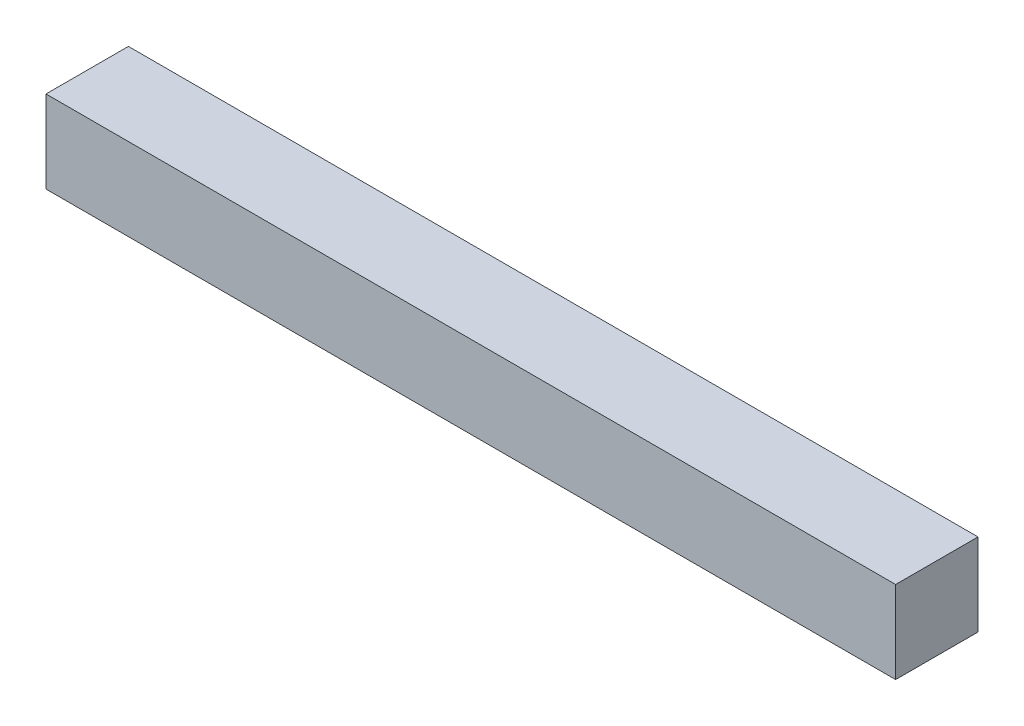
ISO-10303-21;
HEADER;
FILE_DESCRIPTION(('STEP AP214'),'2;1');
FILE_NAME('part.step','',(''),(''),'','','');
FILE_SCHEMA(('AUTOMOTIVE_DESIGN { 1 0 10303 214 1 1 1 1 }'));
ENDSEC;
DATA;
#1=APPLICATION_CONTEXT('core data for automotive mechanical design processes');
#2=APPLICATION_PROTOCOL_DEFINITION('international standard','automotive_design',2000,#1);
#3=PRODUCT_CONTEXT('',#1,'mechanical');
#4=PRODUCT('Part','Part','',(#3));
#5=PRODUCT_RELATED_PRODUCT_CATEGORY('part','',(#4));
#6=PRODUCT_DEFINITION_FORMATION('','',#4);
#7=PRODUCT_DEFINITION_CONTEXT('part definition',#1,'design');
#8=PRODUCT_DEFINITION('design','',#6,#7);
#9=PRODUCT_DEFINITION_SHAPE('','',#8);
#10=(LENGTH_UNIT() NAMED_UNIT(*) SI_UNIT(.MILLI.,.METRE.));
#11=(NAMED_UNIT(*) PLANE_ANGLE_UNIT() SI_UNIT($,.RADIAN.));
#12=(NAMED_UNIT(*) SI_UNIT($,.STERADIAN.) SOLID_ANGLE_UNIT());
#13=UNCERTAINTY_MEASURE_WITH_UNIT(LENGTH_MEASURE(1.E-05),#10,'distance_accuracy_value','');
#14=(GEOMETRIC_REPRESENTATION_CONTEXT(3) GLOBAL_UNCERTAINTY_ASSIGNED_CONTEXT((#13)) GLOBAL_UNIT_ASSIGNED_CONTEXT((#10,
#11,#12)) REPRESENTATION_CONTEXT('',''));
#15=CARTESIAN_POINT('',(0.,0.,0.));
#16=DIRECTION('',(0.,0.,1.));
#17=DIRECTION('',(1.,0.,0.));
#18=AXIS2_PLACEMENT_3D('',#15,#16,#17);
#19=CARTESIAN_POINT('',(1.08279990277916E-13,1.6,1.6));
#20=DIRECTION('',(0.,-1.,0.));
#21=DIRECTION('',(0.,0.,1.));
#22=AXIS2_PLACEMENT_3D('',#19,#20,#21);
#23=PLANE('',#22);
#24=DIRECTION('',(0.,0.,-1.));
#25=VECTOR('',#24,1.);
#26=CARTESIAN_POINT('',(33.0000000000001,1.60000000000012,1.6));
#27=LINE('',#26,#25);
#28=CARTESIAN_POINT('',(33.0000000000001,1.60000000000012,1.6));
#29=VERTEX_POINT('',#28);
#30=CARTESIAN_POINT('',(33.0000000000001,1.60000000000012,-1.6));
#31=VERTEX_POINT('',#30);
#32=EDGE_CURVE('E113',#29,#31,#27,.T.);
#33=ORIENTED_EDGE('',*,*,#32,.T.);
#34=DIRECTION('',(1.,0.,0.));
#35=VECTOR('',#34,1.);
#36=CARTESIAN_POINT('',(1.08279990277916E-13,1.6,-1.6));
#37=LINE('',#36,#35);
#38=CARTESIAN_POINT('',(1.08279990277916E-13,1.6,-1.6));
#39=VERTEX_POINT('',#38);
#40=EDGE_CURVE('E11',#39,#31,#37,.T.);
#41=ORIENTED_EDGE('',*,*,#40,.F.);
#42=DIRECTION('',(0.,0.,-1.));
#43=VECTOR('',#42,1.);
#44=CARTESIAN_POINT('',(1.08279990277916E-13,1.6,1.6));
#45=LINE('',#44,#43);
#46=CARTESIAN_POINT('',(1.08279990277916E-13,1.6,1.6));
#47=VERTEX_POINT('',#46);
#48=EDGE_CURVE('E97',#47,#39,#45,.T.);
#49=ORIENTED_EDGE('',*,*,#48,.F.);
#50=DIRECTION('',(1.,0.,0.));
#51=VECTOR('',#50,1.);
#52=CARTESIAN_POINT('',(1.08279990277916E-13,1.6,1.6));
#53=LINE('',#52,#51);
#54=EDGE_CURVE('E109',#47,#29,#53,.T.);
#55=ORIENTED_EDGE('',*,*,#54,.T.);
#56=EDGE_LOOP('',(#33,#41,#49,#55));
#57=FACE_BOUND('',#56,.T.);
#58=ADVANCED_FACE('F45',(#57),#23,.F.);
#59=CARTESIAN_POINT('',(1.22157778085731E-13,-1.6,-1.6));
#60=DIRECTION('',(0.,0.,1.));
#61=DIRECTION('',(0.,1.,0.));
#62=AXIS2_PLACEMENT_3D('',#59,#60,#61);
#63=PLANE('',#62);
#64=DIRECTION('',(0.,-1.,0.));
#65=VECTOR('',#64,1.);
#66=CARTESIAN_POINT('',(33.0000000000001,-1.59999999999988,-1.6));
#67=LINE('',#66,#65);
#68=CARTESIAN_POINT('',(33.0000000000001,-1.59999999999988,-1.6));
#69=VERTEX_POINT('',#68);
#70=EDGE_CURVE('E102',#31,#69,#67,.T.);
#71=ORIENTED_EDGE('',*,*,#70,.T.);
#72=DIRECTION('',(1.,0.,0.));
#73=VECTOR('',#72,1.);
#74=CARTESIAN_POINT('',(1.22157778085731E-13,-1.6,-1.6));
#75=LINE('',#74,#73);
#76=CARTESIAN_POINT('',(1.22157778085731E-13,-1.6,-1.6));
#77=VERTEX_POINT('',#76);
#78=EDGE_CURVE('E54',#77,#69,#75,.T.);
#79=ORIENTED_EDGE('',*,*,#78,.F.);
#80=DIRECTION('',(0.,-1.,0.));
#81=VECTOR('',#80,1.);
#82=CARTESIAN_POINT('',(1.22157778085731E-13,-1.6,-1.6));
#83=LINE('',#82,#81);
#84=EDGE_CURVE('E92',#39,#77,#83,.T.);
#85=ORIENTED_EDGE('',*,*,#84,.F.);
#86=ORIENTED_EDGE('',*,*,#40,.T.);
#87=EDGE_LOOP('',(#71,#79,#85,#86));
#88=FACE_BOUND('',#87,.T.);
#89=ADVANCED_FACE('F101',(#88),#63,.F.);
#90=CARTESIAN_POINT('',(1.22157778085731E-13,-1.6,1.6));
#91=DIRECTION('',(0.,1.,0.));
#92=DIRECTION('',(0.,0.,-1.));
#93=AXIS2_PLACEMENT_3D('',#90,#91,#92);
#94=PLANE('',#93);
#95=DIRECTION('',(0.,0.,1.));
#96=VECTOR('',#95,1.);
#97=CARTESIAN_POINT('',(33.0000000000001,-1.59999999999988,1.6));
#98=LINE('',#97,#96);
#99=CARTESIAN_POINT('',(33.0000000000001,-1.59999999999988,1.6));
#100=VERTEX_POINT('',#99);
#101=EDGE_CURVE('E79',#69,#100,#98,.T.);
#102=ORIENTED_EDGE('',*,*,#101,.T.);
#103=DIRECTION('',(1.,0.,0.));
#104=VECTOR('',#103,1.);
#105=CARTESIAN_POINT('',(1.22157778085731E-13,-1.6,1.6));
#106=LINE('',#105,#104);
#107=CARTESIAN_POINT('',(1.22157778085731E-13,-1.6,1.6));
#108=VERTEX_POINT('',#107);
#109=EDGE_CURVE('E104',#108,#100,#106,.T.);
#110=ORIENTED_EDGE('',*,*,#109,.F.);
#111=DIRECTION('',(0.,0.,1.));
#112=VECTOR('',#111,1.);
#113=CARTESIAN_POINT('',(1.22157778085731E-13,-1.6,1.6));
#114=LINE('',#113,#112);
#115=EDGE_CURVE('E95',#77,#108,#114,.T.);
#116=ORIENTED_EDGE('',*,*,#115,.F.);
#117=ORIENTED_EDGE('',*,*,#78,.T.);
#118=EDGE_LOOP('',(#102,#110,#116,#117));
#119=FACE_BOUND('',#118,.T.);
#120=ADVANCED_FACE('F105',(#119),#94,.F.);
#121=CARTESIAN_POINT('',(1.22157778085731E-13,-1.6,1.6));
#122=DIRECTION('',(0.,0.,-1.));
#123=DIRECTION('',(0.,-1.,0.));
#124=AXIS2_PLACEMENT_3D('',#121,#122,#123);
#125=PLANE('',#124);
#126=DIRECTION('',(0.,1.,0.));
#127=VECTOR('',#126,1.);
#128=CARTESIAN_POINT('',(33.0000000000001,-1.59999999999988,1.6));
#129=LINE('',#128,#127);
#130=EDGE_CURVE('E85',#100,#29,#129,.T.);
#131=ORIENTED_EDGE('',*,*,#130,.T.);
#132=ORIENTED_EDGE('',*,*,#54,.F.);
#133=DIRECTION('',(0.,1.,0.));
#134=VECTOR('',#133,1.);
#135=CARTESIAN_POINT('',(1.22157778085731E-13,-1.6,1.6));
#136=LINE('',#135,#134);
#137=EDGE_CURVE('E62',#108,#47,#136,.T.);
#138=ORIENTED_EDGE('',*,*,#137,.F.);
#139=ORIENTED_EDGE('',*,*,#109,.T.);
#140=EDGE_LOOP('',(#131,#132,#138,#139));
#141=FACE_BOUND('',#140,.T.);
#142=ADVANCED_FACE('F126',(#141),#125,.F.);
#143=CARTESIAN_POINT('',(1.15218884181823E-13,0.,0.));
#144=DIRECTION('',(1.,0.,0.));
#145=DIRECTION('',(0.,0.,-1.));
#146=AXIS2_PLACEMENT_3D('',#143,#144,#145);
#147=PLANE('',#146);
#148=ORIENTED_EDGE('',*,*,#48,.T.);
#149=ORIENTED_EDGE('',*,*,#84,.T.);
#150=ORIENTED_EDGE('',*,*,#115,.T.);
#151=ORIENTED_EDGE('',*,*,#137,.T.);
#152=EDGE_LOOP('',(#148,#149,#150,#151));
#153=FACE_BOUND('',#152,.T.);
#154=ADVANCED_FACE('F93',(#153),#147,.F.);
#155=CARTESIAN_POINT('',(33.0000000000001,1.17961196366423E-13,0.));
#156=DIRECTION('',(1.,0.,0.));
#157=DIRECTION('',(0.,0.,-1.));
#158=AXIS2_PLACEMENT_3D('',#155,#156,#157);
#159=PLANE('',#158);
#160=ORIENTED_EDGE('',*,*,#32,.F.);
#161=ORIENTED_EDGE('',*,*,#130,.F.);
#162=ORIENTED_EDGE('',*,*,#101,.F.);
#163=ORIENTED_EDGE('',*,*,#70,.F.);
#164=EDGE_LOOP('',(#160,#161,#162,#163));
#165=FACE_BOUND('',#164,.T.);
#166=ADVANCED_FACE('F129',(#165),#159,.T.);
#167=CLOSED_SHELL('',(#58,#89,#120,#142,#154,#166));
#168=MANIFOLD_SOLID_BREP('B2',#167);
#169=ADVANCED_BREP_SHAPE_REPRESENTATION('',(#18,#168),#14);
#170=SHAPE_DEFINITION_REPRESENTATION(#9,#169);
ENDSEC;
END-ISO-10303-21;
